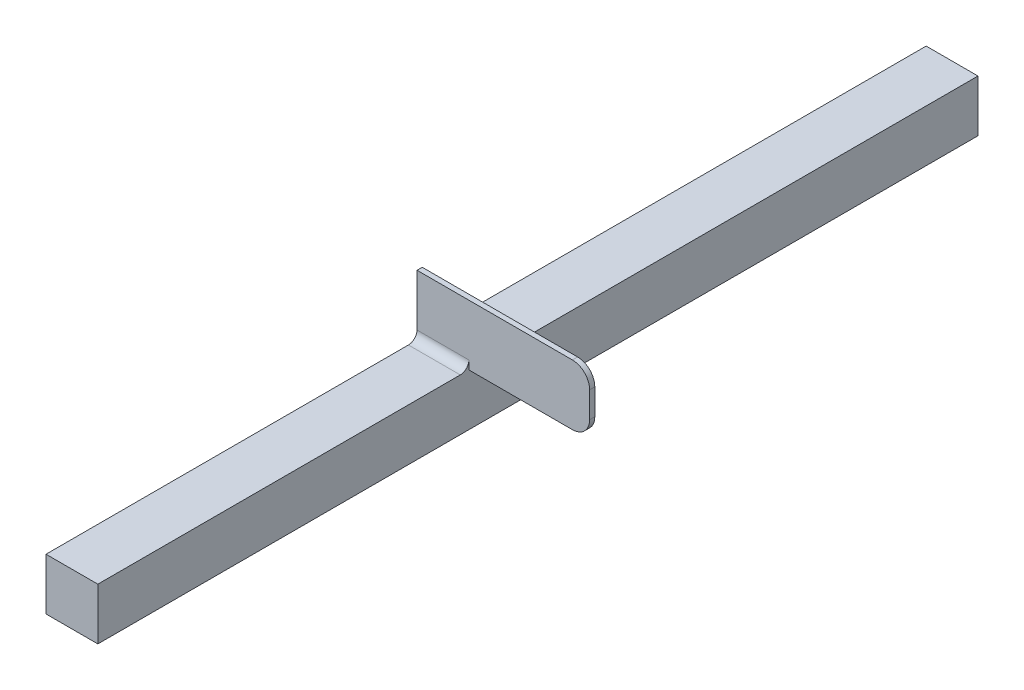
ISO-10303-21;
HEADER;
FILE_DESCRIPTION(('STEP AP214'),'2;1');
FILE_NAME('part.step','',(''),(''),'','','');
FILE_SCHEMA(('AUTOMOTIVE_DESIGN { 1 0 10303 214 1 1 1 1 }'));
ENDSEC;
DATA;
#1=APPLICATION_CONTEXT('core data for automotive mechanical design processes');
#2=APPLICATION_PROTOCOL_DEFINITION('international standard','automotive_design',2000,#1);
#3=PRODUCT_CONTEXT('',#1,'mechanical');
#4=PRODUCT('Part','Part','',(#3));
#5=PRODUCT_RELATED_PRODUCT_CATEGORY('part','',(#4));
#6=PRODUCT_DEFINITION_FORMATION('','',#4);
#7=PRODUCT_DEFINITION_CONTEXT('part definition',#1,'design');
#8=PRODUCT_DEFINITION('design','',#6,#7);
#9=PRODUCT_DEFINITION_SHAPE('','',#8);
#10=(LENGTH_UNIT() NAMED_UNIT(*) SI_UNIT(.MILLI.,.METRE.));
#11=(NAMED_UNIT(*) PLANE_ANGLE_UNIT() SI_UNIT($,.RADIAN.));
#12=(NAMED_UNIT(*) SI_UNIT($,.STERADIAN.) SOLID_ANGLE_UNIT());
#13=UNCERTAINTY_MEASURE_WITH_UNIT(LENGTH_MEASURE(1.E-05),#10,'distance_accuracy_value','');
#14=(GEOMETRIC_REPRESENTATION_CONTEXT(3) GLOBAL_UNCERTAINTY_ASSIGNED_CONTEXT((#13)) GLOBAL_UNIT_ASSIGNED_CONTEXT((#10,
#11,#12)) REPRESENTATION_CONTEXT('',''));
#15=CARTESIAN_POINT('',(0.,0.,0.));
#16=DIRECTION('',(0.,0.,1.));
#17=DIRECTION('',(1.,0.,0.));
#18=AXIS2_PLACEMENT_3D('',#15,#16,#17);
#19=CARTESIAN_POINT('',(-110.658276121753,30.,255.));
#20=DIRECTION('',(0.,-1.,0.));
#21=DIRECTION('',(0.,0.,-1.));
#22=AXIS2_PLACEMENT_3D('',#19,#20,#21);
#23=PLANE('',#22);
#24=DIRECTION('',(0.,0.,-1.));
#25=VECTOR('',#24,1.);
#26=CARTESIAN_POINT('',(-80.6128609512064,30.,255.));
#27=LINE('',#26,#25);
#28=CARTESIAN_POINT('',(-80.6128609512064,30.,255.));
#29=VERTEX_POINT('',#28);
#30=CARTESIAN_POINT('',(-80.6128609512064,30.,45.001));
#31=VERTEX_POINT('',#30);
#32=EDGE_CURVE('E221',#29,#31,#27,.T.);
#33=ORIENTED_EDGE('',*,*,#32,.T.);
#34=DIRECTION('',(1.,0.,0.));
#35=VECTOR('',#34,1.);
#36=CARTESIAN_POINT('',(-110.658276121753,30.,45.001));
#37=LINE('',#36,#35);
#38=CARTESIAN_POINT('',(-110.658276121753,30.,45.001));
#39=VERTEX_POINT('',#38);
#40=EDGE_CURVE('E251',#31,#39,#37,.F.);
#41=ORIENTED_EDGE('',*,*,#40,.T.);
#42=DIRECTION('',(0.,0.,-1.));
#43=VECTOR('',#42,1.);
#44=CARTESIAN_POINT('',(-110.658276121753,30.,255.));
#45=LINE('',#44,#43);
#46=CARTESIAN_POINT('',(-110.658276121753,30.,255.));
#47=VERTEX_POINT('',#46);
#48=EDGE_CURVE('E217',#47,#39,#45,.T.);
#49=ORIENTED_EDGE('',*,*,#48,.F.);
#50=DIRECTION('',(-1.,0.,0.));
#51=VECTOR('',#50,1.);
#52=CARTESIAN_POINT('',(-110.658276121753,30.,255.));
#53=LINE('',#52,#51);
#54=EDGE_CURVE('E201',#29,#47,#53,.T.);
#55=ORIENTED_EDGE('',*,*,#54,.F.);
#56=EDGE_LOOP('',(#33,#41,#49,#55));
#57=FACE_BOUND('',#56,.T.);
#58=ADVANCED_FACE('F39',(#57),#23,.F.);
#59=CARTESIAN_POINT('',(-110.658276121753,30.,255.));
#60=DIRECTION('',(1.,0.,0.));
#61=DIRECTION('',(0.,0.,-1.));
#62=AXIS2_PLACEMENT_3D('',#59,#60,#61);
#63=PLANE('',#62);
#64=DIRECTION('',(0.,-1.,0.));
#65=VECTOR('',#64,1.);
#66=CARTESIAN_POINT('',(-110.658276121753,30.,-255.));
#67=LINE('',#66,#65);
#68=CARTESIAN_POINT('',(-110.658276121753,30.,-255.));
#69=VERTEX_POINT('',#68);
#70=CARTESIAN_POINT('',(-110.658276121753,0.,-255.));
#71=VERTEX_POINT('',#70);
#72=EDGE_CURVE('E163',#69,#71,#67,.T.);
#73=ORIENTED_EDGE('',*,*,#72,.T.);
#74=DIRECTION('',(0.,0.,-1.));
#75=VECTOR('',#74,1.);
#76=CARTESIAN_POINT('',(-110.658276121753,0.,255.));
#77=LINE('',#76,#75);
#78=CARTESIAN_POINT('',(-110.658276121753,0.,255.));
#79=VERTEX_POINT('',#78);
#80=EDGE_CURVE('E230',#79,#71,#77,.T.);
#81=ORIENTED_EDGE('',*,*,#80,.F.);
#82=DIRECTION('',(0.,-1.,0.));
#83=VECTOR('',#82,1.);
#84=CARTESIAN_POINT('',(-110.658276121753,30.,255.));
#85=LINE('',#84,#83);
#86=EDGE_CURVE('E190',#47,#79,#85,.T.);
#87=ORIENTED_EDGE('',*,*,#86,.F.);
#88=ORIENTED_EDGE('',*,*,#48,.T.);
#89=CARTESIAN_POINT('',(-110.658276121753,35.,45.001));
#90=DIRECTION('',(1.,0.,0.));
#91=DIRECTION('',(0.,0.,-1.));
#92=AXIS2_PLACEMENT_3D('',#89,#90,#91);
#93=CIRCLE('',#92,5.);
#94=CARTESIAN_POINT('',(-110.658276121753,35.,40.001));
#95=VERTEX_POINT('',#94);
#96=EDGE_CURVE('E170',#39,#95,#93,.T.);
#97=ORIENTED_EDGE('',*,*,#96,.T.);
#98=DIRECTION('',(0.,-1.,0.));
#99=VECTOR('',#98,1.);
#100=CARTESIAN_POINT('',(-110.658276121753,30.,40.001));
#101=LINE('',#100,#99);
#102=CARTESIAN_POINT('',(-110.658276121753,65.,40.001));
#103=VERTEX_POINT('',#102);
#104=EDGE_CURVE('E149',#103,#95,#101,.T.);
#105=ORIENTED_EDGE('',*,*,#104,.F.);
#106=DIRECTION('',(0.,0.,1.));
#107=VECTOR('',#106,1.);
#108=CARTESIAN_POINT('',(-110.658276121753,65.,37.));
#109=LINE('',#108,#107);
#110=CARTESIAN_POINT('',(-110.658276121753,65.,37.));
#111=VERTEX_POINT('',#110);
#112=EDGE_CURVE('E156',#111,#103,#109,.T.);
#113=ORIENTED_EDGE('',*,*,#112,.F.);
#114=DIRECTION('',(0.,-1.,0.));
#115=VECTOR('',#114,1.);
#116=CARTESIAN_POINT('',(-110.658276121753,30.,37.));
#117=LINE('',#116,#115);
#118=CARTESIAN_POINT('',(-110.658276121753,35.,37.));
#119=VERTEX_POINT('',#118);
#120=EDGE_CURVE('E185',#111,#119,#117,.T.);
#121=ORIENTED_EDGE('',*,*,#120,.T.);
#122=CARTESIAN_POINT('',(-110.658276121753,35.,32.));
#123=DIRECTION('',(1.,0.,0.));
#124=DIRECTION('',(0.,0.,-1.));
#125=AXIS2_PLACEMENT_3D('',#122,#123,#124);
#126=CIRCLE('',#125,5.);
#127=CARTESIAN_POINT('',(-110.658276121753,30.,32.));
#128=VERTEX_POINT('',#127);
#129=EDGE_CURVE('E257',#119,#128,#126,.T.);
#130=ORIENTED_EDGE('',*,*,#129,.T.);
#131=EDGE_CURVE('E204',#128,#69,#45,.T.);
#132=ORIENTED_EDGE('',*,*,#131,.T.);
#133=EDGE_LOOP('',(#73,#81,#87,#88,#97,#105,#113,#121,#130,#132));
#134=FACE_BOUND('',#133,.T.);
#135=ADVANCED_FACE('F167',(#134),#63,.F.);
#136=CARTESIAN_POINT('',(-110.658276121753,0.,255.));
#137=DIRECTION('',(0.,1.,0.));
#138=DIRECTION('',(0.,0.,1.));
#139=AXIS2_PLACEMENT_3D('',#136,#137,#138);
#140=PLANE('',#139);
#141=DIRECTION('',(1.,0.,0.));
#142=VECTOR('',#141,1.);
#143=CARTESIAN_POINT('',(-110.658276121753,0.,-255.));
#144=LINE('',#143,#142);
#145=CARTESIAN_POINT('',(-80.6128609512064,0.,-255.));
#146=VERTEX_POINT('',#145);
#147=EDGE_CURVE('E207',#71,#146,#144,.T.);
#148=ORIENTED_EDGE('',*,*,#147,.T.);
#149=DIRECTION('',(0.,0.,-1.));
#150=VECTOR('',#149,1.);
#151=CARTESIAN_POINT('',(-80.6128609512064,0.,255.));
#152=LINE('',#151,#150);
#153=CARTESIAN_POINT('',(-80.6128609512064,0.,255.));
#154=VERTEX_POINT('',#153);
#155=EDGE_CURVE('E225',#154,#146,#152,.T.);
#156=ORIENTED_EDGE('',*,*,#155,.F.);
#157=DIRECTION('',(1.,0.,0.));
#158=VECTOR('',#157,1.);
#159=CARTESIAN_POINT('',(-110.658276121753,0.,255.));
#160=LINE('',#159,#158);
#161=EDGE_CURVE('E194',#79,#154,#160,.T.);
#162=ORIENTED_EDGE('',*,*,#161,.F.);
#163=ORIENTED_EDGE('',*,*,#80,.T.);
#164=EDGE_LOOP('',(#148,#156,#162,#163));
#165=FACE_BOUND('',#164,.T.);
#166=ADVANCED_FACE('F309',(#165),#140,.F.);
#167=CARTESIAN_POINT('',(-80.6128609512064,30.,255.));
#168=DIRECTION('',(-1.,0.,0.));
#169=DIRECTION('',(0.,0.,1.));
#170=AXIS2_PLACEMENT_3D('',#167,#168,#169);
#171=PLANE('',#170);
#172=DIRECTION('',(0.,1.,0.));
#173=VECTOR('',#172,1.);
#174=CARTESIAN_POINT('',(-80.6128609512064,30.,-255.));
#175=LINE('',#174,#173);
#176=CARTESIAN_POINT('',(-80.6128609512064,30.,-255.));
#177=VERTEX_POINT('',#176);
#178=EDGE_CURVE('E210',#146,#177,#175,.T.);
#179=ORIENTED_EDGE('',*,*,#178,.T.);
#180=CARTESIAN_POINT('',(-80.6128609512064,30.,32.));
#181=VERTEX_POINT('',#180);
#182=EDGE_CURVE('E220',#181,#177,#27,.T.);
#183=ORIENTED_EDGE('',*,*,#182,.F.);
#184=CARTESIAN_POINT('',(-80.6128609512064,35.,32.));
#185=DIRECTION('',(-1.,0.,0.));
#186=DIRECTION('',(0.,0.,1.));
#187=AXIS2_PLACEMENT_3D('',#184,#185,#186);
#188=CIRCLE('',#187,5.);
#189=CARTESIAN_POINT('',(-80.6128609512064,35.,37.));
#190=VERTEX_POINT('',#189);
#191=EDGE_CURVE('E254',#181,#190,#188,.T.);
#192=ORIENTED_EDGE('',*,*,#191,.T.);
#193=DIRECTION('',(0.,1.,0.));
#194=VECTOR('',#193,1.);
#195=CARTESIAN_POINT('',(-80.6128609512064,30.,37.));
#196=LINE('',#195,#194);
#197=CARTESIAN_POINT('',(-80.6128609512064,30.,37.));
#198=VERTEX_POINT('',#197);
#199=EDGE_CURVE('E241',#198,#190,#196,.T.);
#200=ORIENTED_EDGE('',*,*,#199,.F.);
#201=CARTESIAN_POINT('',(-80.6128609512063,30.,40.001));
#202=VERTEX_POINT('',#201);
#203=EDGE_CURVE('E226',#202,#198,#27,.T.);
#204=ORIENTED_EDGE('',*,*,#203,.F.);
#205=DIRECTION('',(0.,-1.,0.));
#206=VECTOR('',#205,1.);
#207=CARTESIAN_POINT('',(-80.6128609512064,0.,40.001));
#208=LINE('',#207,#206);
#209=CARTESIAN_POINT('',(-80.6128609512064,35.,40.001));
#210=VERTEX_POINT('',#209);
#211=EDGE_CURVE('E245',#210,#202,#208,.T.);
#212=ORIENTED_EDGE('',*,*,#211,.F.);
#213=CARTESIAN_POINT('',(-80.6128609512064,35.,45.001));
#214=DIRECTION('',(-1.,0.,0.));
#215=DIRECTION('',(0.,0.,1.));
#216=AXIS2_PLACEMENT_3D('',#213,#214,#215);
#217=CIRCLE('',#216,5.);
#218=EDGE_CURVE('E260',#210,#31,#217,.T.);
#219=ORIENTED_EDGE('',*,*,#218,.T.);
#220=ORIENTED_EDGE('',*,*,#32,.F.);
#221=DIRECTION('',(0.,1.,0.));
#222=VECTOR('',#221,1.);
#223=CARTESIAN_POINT('',(-80.6128609512064,30.,255.));
#224=LINE('',#223,#222);
#225=EDGE_CURVE('E198',#154,#29,#224,.T.);
#226=ORIENTED_EDGE('',*,*,#225,.F.);
#227=ORIENTED_EDGE('',*,*,#155,.T.);
#228=EDGE_LOOP('',(#179,#183,#192,#200,#204,#212,#219,#220,#226,#227));
#229=FACE_BOUND('',#228,.T.);
#230=ADVANCED_FACE('F315',(#229),#171,.F.);
#231=ORIENTED_EDGE('',*,*,#131,.F.);
#232=DIRECTION('',(1.,0.,0.));
#233=VECTOR('',#232,1.);
#234=CARTESIAN_POINT('',(-80.6128609512064,30.,32.));
#235=LINE('',#234,#233);
#236=EDGE_CURVE('E234',#128,#181,#235,.T.);
#237=ORIENTED_EDGE('',*,*,#236,.T.);
#238=ORIENTED_EDGE('',*,*,#182,.T.);
#239=DIRECTION('',(-1.,0.,0.));
#240=VECTOR('',#239,1.);
#241=CARTESIAN_POINT('',(-110.658276121753,30.,-255.));
#242=LINE('',#241,#240);
#243=EDGE_CURVE('E195',#177,#69,#242,.T.);
#244=ORIENTED_EDGE('',*,*,#243,.T.);
#245=EDGE_LOOP('',(#231,#237,#238,#244));
#246=FACE_BOUND('',#245,.T.);
#247=ADVANCED_FACE('F303',(#246),#23,.F.);
#248=CARTESIAN_POINT('',(0.,0.,255.));
#249=DIRECTION('',(0.,0.,1.));
#250=DIRECTION('',(1.,0.,0.));
#251=AXIS2_PLACEMENT_3D('',#248,#249,#250);
#252=PLANE('',#251);
#253=ORIENTED_EDGE('',*,*,#86,.T.);
#254=ORIENTED_EDGE('',*,*,#161,.T.);
#255=ORIENTED_EDGE('',*,*,#225,.T.);
#256=ORIENTED_EDGE('',*,*,#54,.T.);
#257=EDGE_LOOP('',(#253,#254,#255,#256));
#258=FACE_BOUND('',#257,.T.);
#259=ADVANCED_FACE('F314',(#258),#252,.T.);
#260=CARTESIAN_POINT('',(0.,0.,-255.));
#261=DIRECTION('',(0.,0.,1.));
#262=DIRECTION('',(1.,0.,0.));
#263=AXIS2_PLACEMENT_3D('',#260,#261,#262);
#264=PLANE('',#263);
#265=ORIENTED_EDGE('',*,*,#72,.F.);
#266=ORIENTED_EDGE('',*,*,#243,.F.);
#267=ORIENTED_EDGE('',*,*,#178,.F.);
#268=ORIENTED_EDGE('',*,*,#147,.F.);
#269=EDGE_LOOP('',(#265,#266,#267,#268));
#270=FACE_BOUND('',#269,.T.);
#271=ADVANCED_FACE('F322',(#270),#264,.F.);
#272=CARTESIAN_POINT('',(-10.658276121753,30.,37.));
#273=DIRECTION('',(1.,0.,0.));
#274=DIRECTION('',(0.,0.,-1.));
#275=AXIS2_PLACEMENT_3D('',#272,#273,#274);
#276=PLANE('',#275);
#277=DIRECTION('',(0.,1.,0.));
#278=VECTOR('',#277,1.);
#279=CARTESIAN_POINT('',(-10.658276121753,30.,37.));
#280=LINE('',#279,#278);
#281=CARTESIAN_POINT('',(-10.658276121753,40.,37.));
#282=VERTEX_POINT('',#281);
#283=CARTESIAN_POINT('',(-10.658276121753,55.,37.));
#284=VERTEX_POINT('',#283);
#285=EDGE_CURVE('E176',#282,#284,#280,.T.);
#286=ORIENTED_EDGE('',*,*,#285,.T.);
#287=DIRECTION('',(0.,0.,1.));
#288=VECTOR('',#287,1.);
#289=CARTESIAN_POINT('',(-10.658276121753,55.,37.));
#290=LINE('',#289,#288);
#291=CARTESIAN_POINT('',(-10.658276121753,55.,40.001));
#292=VERTEX_POINT('',#291);
#293=EDGE_CURVE('E268',#284,#292,#290,.T.);
#294=ORIENTED_EDGE('',*,*,#293,.T.);
#295=DIRECTION('',(0.,1.,0.));
#296=VECTOR('',#295,1.);
#297=CARTESIAN_POINT('',(-10.658276121753,30.,40.001));
#298=LINE('',#297,#296);
#299=CARTESIAN_POINT('',(-10.658276121753,40.,40.001));
#300=VERTEX_POINT('',#299);
#301=EDGE_CURVE('E153',#300,#292,#298,.T.);
#302=ORIENTED_EDGE('',*,*,#301,.F.);
#303=DIRECTION('',(0.,0.,1.));
#304=VECTOR('',#303,1.);
#305=CARTESIAN_POINT('',(-10.658276121753,40.,37.));
#306=LINE('',#305,#304);
#307=EDGE_CURVE('E265',#300,#282,#306,.F.);
#308=ORIENTED_EDGE('',*,*,#307,.T.);
#309=EDGE_LOOP('',(#286,#294,#302,#308));
#310=FACE_BOUND('',#309,.T.);
#311=ADVANCED_FACE('F286',(#310),#276,.T.);
#312=CARTESIAN_POINT('',(-10.658276121753,30.,37.));
#313=DIRECTION('',(0.,-1.,0.));
#314=DIRECTION('',(1.,0.,0.));
#315=AXIS2_PLACEMENT_3D('',#312,#313,#314);
#316=PLANE('',#315);
#317=DIRECTION('',(1.,0.,0.));
#318=VECTOR('',#317,1.);
#319=CARTESIAN_POINT('',(-10.658276121753,30.,37.));
#320=LINE('',#319,#318);
#321=CARTESIAN_POINT('',(-20.658276121753,30.,37.));
#322=VERTEX_POINT('',#321);
#323=EDGE_CURVE('E164',#198,#322,#320,.T.);
#324=ORIENTED_EDGE('',*,*,#323,.T.);
#325=DIRECTION('',(0.,0.,1.));
#326=VECTOR('',#325,1.);
#327=CARTESIAN_POINT('',(-20.658276121753,30.,37.));
#328=LINE('',#327,#326);
#329=CARTESIAN_POINT('',(-20.658276121753,30.,40.001));
#330=VERTEX_POINT('',#329);
#331=EDGE_CURVE('E11',#322,#330,#328,.T.);
#332=ORIENTED_EDGE('',*,*,#331,.T.);
#333=DIRECTION('',(1.,0.,0.));
#334=VECTOR('',#333,1.);
#335=CARTESIAN_POINT('',(-10.658276121753,30.,40.001));
#336=LINE('',#335,#334);
#337=EDGE_CURVE('E172',#202,#330,#336,.T.);
#338=ORIENTED_EDGE('',*,*,#337,.F.);
#339=ORIENTED_EDGE('',*,*,#203,.T.);
#340=EDGE_LOOP('',(#324,#332,#338,#339));
#341=FACE_BOUND('',#340,.T.);
#342=ADVANCED_FACE('F340',(#341),#316,.T.);
#343=CARTESIAN_POINT('',(-10.658276121753,65.,37.));
#344=DIRECTION('',(0.,1.,0.));
#345=DIRECTION('',(-1.,0.,0.));
#346=AXIS2_PLACEMENT_3D('',#343,#344,#345);
#347=PLANE('',#346);
#348=DIRECTION('',(-1.,0.,0.));
#349=VECTOR('',#348,1.);
#350=CARTESIAN_POINT('',(-10.658276121753,65.,40.001));
#351=LINE('',#350,#349);
#352=CARTESIAN_POINT('',(-20.658276121753,65.,40.001));
#353=VERTEX_POINT('',#352);
#354=EDGE_CURVE('E143',#353,#103,#351,.T.);
#355=ORIENTED_EDGE('',*,*,#354,.F.);
#356=DIRECTION('',(0.,0.,1.));
#357=VECTOR('',#356,1.);
#358=CARTESIAN_POINT('',(-20.658276121753,65.,37.));
#359=LINE('',#358,#357);
#360=CARTESIAN_POINT('',(-20.658276121753,65.,37.));
#361=VERTEX_POINT('',#360);
#362=EDGE_CURVE('E63',#353,#361,#359,.F.);
#363=ORIENTED_EDGE('',*,*,#362,.T.);
#364=DIRECTION('',(-1.,0.,0.));
#365=VECTOR('',#364,1.);
#366=CARTESIAN_POINT('',(-10.658276121753,65.,37.));
#367=LINE('',#366,#365);
#368=EDGE_CURVE('E158',#361,#111,#367,.T.);
#369=ORIENTED_EDGE('',*,*,#368,.T.);
#370=ORIENTED_EDGE('',*,*,#112,.T.);
#371=EDGE_LOOP('',(#355,#363,#369,#370));
#372=FACE_BOUND('',#371,.T.);
#373=ADVANCED_FACE('F157',(#372),#347,.T.);
#374=CARTESIAN_POINT('',(0.,0.,37.));
#375=DIRECTION('',(0.,0.,1.));
#376=DIRECTION('',(1.,0.,0.));
#377=AXIS2_PLACEMENT_3D('',#374,#375,#376);
#378=PLANE('',#377);
#379=ORIENTED_EDGE('',*,*,#368,.F.);
#380=CARTESIAN_POINT('',(-20.658276121753,55.,37.));
#381=DIRECTION('',(0.,0.,1.));
#382=DIRECTION('',(1.,0.,0.));
#383=AXIS2_PLACEMENT_3D('',#380,#381,#382);
#384=CIRCLE('',#383,10.);
#385=EDGE_CURVE('E48',#361,#284,#384,.F.);
#386=ORIENTED_EDGE('',*,*,#385,.T.);
#387=ORIENTED_EDGE('',*,*,#285,.F.);
#388=CARTESIAN_POINT('',(-20.658276121753,40.,37.));
#389=DIRECTION('',(0.,0.,1.));
#390=DIRECTION('',(1.,0.,0.));
#391=AXIS2_PLACEMENT_3D('',#388,#389,#390);
#392=CIRCLE('',#391,10.);
#393=EDGE_CURVE('E55',#282,#322,#392,.F.);
#394=ORIENTED_EDGE('',*,*,#393,.T.);
#395=ORIENTED_EDGE('',*,*,#323,.F.);
#396=ORIENTED_EDGE('',*,*,#199,.T.);
#397=DIRECTION('',(1.,0.,0.));
#398=VECTOR('',#397,1.);
#399=CARTESIAN_POINT('',(-110.658276121753,35.,37.));
#400=LINE('',#399,#398);
#401=EDGE_CURVE('E238',#190,#119,#400,.F.);
#402=ORIENTED_EDGE('',*,*,#401,.T.);
#403=ORIENTED_EDGE('',*,*,#120,.F.);
#404=EDGE_LOOP('',(#379,#386,#387,#394,#395,#396,#402,#403));
#405=FACE_BOUND('',#404,.T.);
#406=ADVANCED_FACE('F282',(#405),#378,.F.);
#407=CARTESIAN_POINT('',(0.,0.,40.001));
#408=DIRECTION('',(0.,0.,1.));
#409=DIRECTION('',(1.,0.,0.));
#410=AXIS2_PLACEMENT_3D('',#407,#408,#409);
#411=PLANE('',#410);
#412=ORIENTED_EDGE('',*,*,#301,.T.);
#413=CARTESIAN_POINT('',(-20.658276121753,55.,40.001));
#414=DIRECTION('',(0.,0.,1.));
#415=DIRECTION('',(1.,0.,0.));
#416=AXIS2_PLACEMENT_3D('',#413,#414,#415);
#417=CIRCLE('',#416,10.);
#418=EDGE_CURVE('E151',#292,#353,#417,.T.);
#419=ORIENTED_EDGE('',*,*,#418,.T.);
#420=ORIENTED_EDGE('',*,*,#354,.T.);
#421=ORIENTED_EDGE('',*,*,#104,.T.);
#422=DIRECTION('',(1.,0.,0.));
#423=VECTOR('',#422,1.);
#424=CARTESIAN_POINT('',(0.,35.,40.001));
#425=LINE('',#424,#423);
#426=EDGE_CURVE('E248',#95,#210,#425,.T.);
#427=ORIENTED_EDGE('',*,*,#426,.T.);
#428=ORIENTED_EDGE('',*,*,#211,.T.);
#429=ORIENTED_EDGE('',*,*,#337,.T.);
#430=CARTESIAN_POINT('',(-20.658276121753,40.,40.001));
#431=DIRECTION('',(0.,0.,1.));
#432=DIRECTION('',(1.,0.,0.));
#433=AXIS2_PLACEMENT_3D('',#430,#431,#432);
#434=CIRCLE('',#433,10.);
#435=EDGE_CURVE('E272',#330,#300,#434,.T.);
#436=ORIENTED_EDGE('',*,*,#435,.T.);
#437=EDGE_LOOP('',(#412,#419,#420,#421,#427,#428,#429,#436));
#438=FACE_BOUND('',#437,.T.);
#439=ADVANCED_FACE('F146',(#438),#411,.T.);
#440=CARTESIAN_POINT('',(-110.658276121753,35.,32.));
#441=DIRECTION('',(-1.,0.,0.));
#442=DIRECTION('',(0.,0.,1.));
#443=AXIS2_PLACEMENT_3D('',#440,#441,#442);
#444=CYLINDRICAL_SURFACE('',#443,5.);
#445=ORIENTED_EDGE('',*,*,#129,.F.);
#446=ORIENTED_EDGE('',*,*,#401,.F.);
#447=ORIENTED_EDGE('',*,*,#191,.F.);
#448=ORIENTED_EDGE('',*,*,#236,.F.);
#449=EDGE_LOOP('',(#445,#446,#447,#448));
#450=FACE_BOUND('',#449,.T.);
#451=ADVANCED_FACE('F297',(#450),#444,.F.);
#452=CARTESIAN_POINT('',(0.,35.,45.001));
#453=DIRECTION('',(1.,0.,0.));
#454=DIRECTION('',(0.,0.,-1.));
#455=AXIS2_PLACEMENT_3D('',#452,#453,#454);
#456=CYLINDRICAL_SURFACE('',#455,5.);
#457=ORIENTED_EDGE('',*,*,#96,.F.);
#458=ORIENTED_EDGE('',*,*,#40,.F.);
#459=ORIENTED_EDGE('',*,*,#218,.F.);
#460=ORIENTED_EDGE('',*,*,#426,.F.);
#461=EDGE_LOOP('',(#457,#458,#459,#460));
#462=FACE_BOUND('',#461,.T.);
#463=ADVANCED_FACE('F291',(#462),#456,.F.);
#464=CARTESIAN_POINT('',(-20.658276121753,55.,37.));
#465=DIRECTION('',(0.,0.,1.));
#466=DIRECTION('',(1.,0.,0.));
#467=AXIS2_PLACEMENT_3D('',#464,#465,#466);
#468=CYLINDRICAL_SURFACE('',#467,10.);
#469=ORIENTED_EDGE('',*,*,#385,.F.);
#470=ORIENTED_EDGE('',*,*,#362,.F.);
#471=ORIENTED_EDGE('',*,*,#418,.F.);
#472=ORIENTED_EDGE('',*,*,#293,.F.);
#473=EDGE_LOOP('',(#469,#470,#471,#472));
#474=FACE_BOUND('',#473,.T.);
#475=ADVANCED_FACE('F289',(#474),#468,.T.);
#476=CARTESIAN_POINT('',(-20.658276121753,40.,37.));
#477=DIRECTION('',(0.,0.,1.));
#478=DIRECTION('',(1.,0.,0.));
#479=AXIS2_PLACEMENT_3D('',#476,#477,#478);
#480=CYLINDRICAL_SURFACE('',#479,10.);
#481=ORIENTED_EDGE('',*,*,#393,.F.);
#482=ORIENTED_EDGE('',*,*,#307,.F.);
#483=ORIENTED_EDGE('',*,*,#435,.F.);
#484=ORIENTED_EDGE('',*,*,#331,.F.);
#485=EDGE_LOOP('',(#481,#482,#483,#484));
#486=FACE_BOUND('',#485,.T.);
#487=ADVANCED_FACE('F41',(#486),#480,.T.);
#488=CLOSED_SHELL('',(#58,#135,#166,#230,#247,#259,#271,#311,#342,#373,#406,#439,#451,#463,#475,#487));
#489=MANIFOLD_SOLID_BREP('B2',#488);
#490=ADVANCED_BREP_SHAPE_REPRESENTATION('',(#18,#489),#14);
#491=SHAPE_DEFINITION_REPRESENTATION(#9,#490);
ENDSEC;
END-ISO-10303-21;
